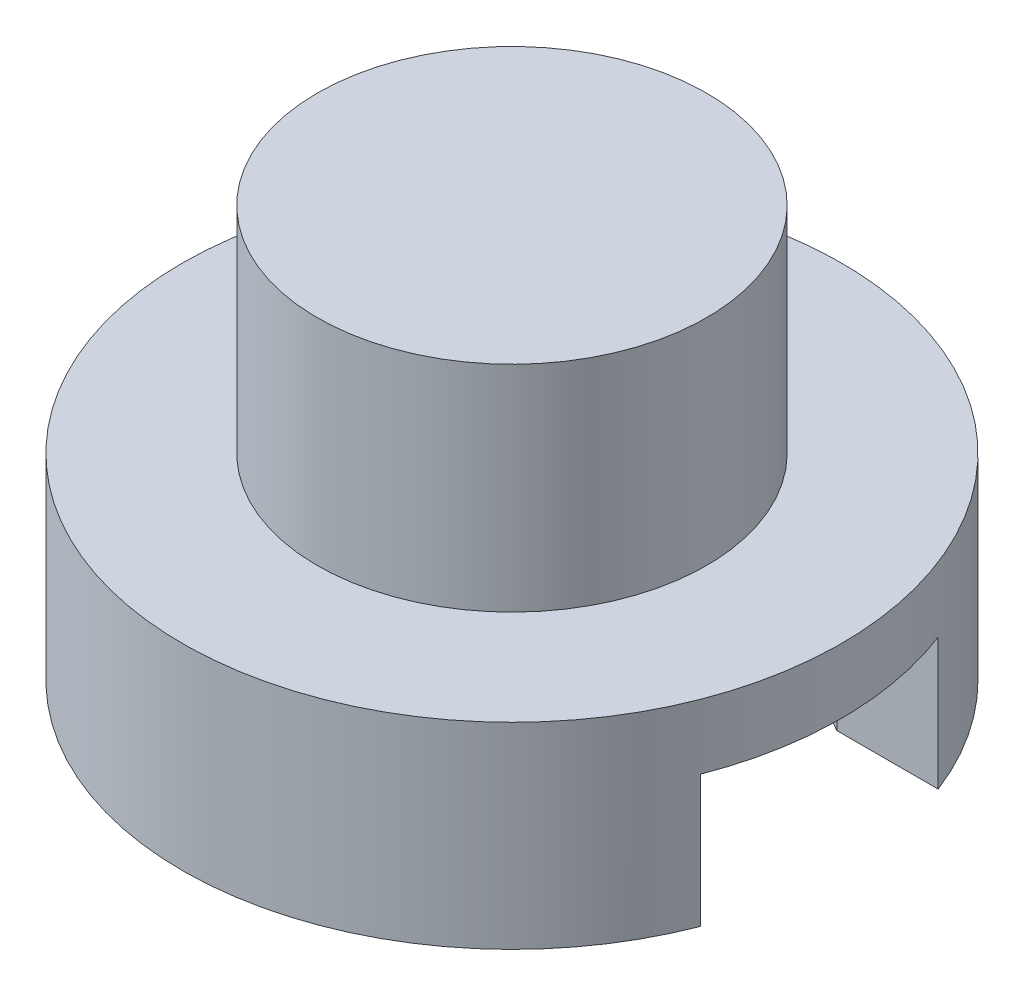
ISO-10303-21;
HEADER;
FILE_DESCRIPTION(('STEP AP214'),'2;1');
FILE_NAME('part.step','',(''),(''),'','','');
FILE_SCHEMA(('AUTOMOTIVE_DESIGN { 1 0 10303 214 1 1 1 1 }'));
ENDSEC;
DATA;
#1=APPLICATION_CONTEXT('core data for automotive mechanical design processes');
#2=APPLICATION_PROTOCOL_DEFINITION('international standard','automotive_design',2000,#1);
#3=PRODUCT_CONTEXT('',#1,'mechanical');
#4=PRODUCT('Part','Part','',(#3));
#5=PRODUCT_RELATED_PRODUCT_CATEGORY('part','',(#4));
#6=PRODUCT_DEFINITION_FORMATION('','',#4);
#7=PRODUCT_DEFINITION_CONTEXT('part definition',#1,'design');
#8=PRODUCT_DEFINITION('design','',#6,#7);
#9=PRODUCT_DEFINITION_SHAPE('','',#8);
#10=(LENGTH_UNIT() NAMED_UNIT(*) SI_UNIT(.MILLI.,.METRE.));
#11=(NAMED_UNIT(*) PLANE_ANGLE_UNIT() SI_UNIT($,.RADIAN.));
#12=(NAMED_UNIT(*) SI_UNIT($,.STERADIAN.) SOLID_ANGLE_UNIT());
#13=UNCERTAINTY_MEASURE_WITH_UNIT(LENGTH_MEASURE(1.E-05),#10,'distance_accuracy_value','');
#14=(GEOMETRIC_REPRESENTATION_CONTEXT(3) GLOBAL_UNCERTAINTY_ASSIGNED_CONTEXT((#13)) GLOBAL_UNIT_ASSIGNED_CONTEXT((#10,
#11,#12)) REPRESENTATION_CONTEXT('',''));
#15=CARTESIAN_POINT('',(0.,0.,0.));
#16=DIRECTION('',(0.,0.,1.));
#17=DIRECTION('',(1.,0.,0.));
#18=AXIS2_PLACEMENT_3D('',#15,#16,#17);
#19=CARTESIAN_POINT('',(2.51046511627907,25.25346,12.7));
#20=DIRECTION('',(0.,-1.,0.));
#21=DIRECTION('',(1.,0.,0.));
#22=AXIS2_PLACEMENT_3D('',#19,#20,#21);
#23=CYLINDRICAL_SURFACE('',#22,12.7);
#24=DIRECTION('',(0.,-1.,0.));
#25=VECTOR('',#24,1.);
#26=CARTESIAN_POINT('',(14.3548181132421,25.25346,8.11728223830729));
#27=LINE('',#26,#25);
#28=CARTESIAN_POINT('',(14.3548181132421,25.25346,8.11728223830729));
#29=VERTEX_POINT('',#28);
#30=CARTESIAN_POINT('',(14.3548181132421,20.17346,8.11728223830729));
#31=VERTEX_POINT('',#30);
#32=EDGE_CURVE('E142',#29,#31,#27,.T.);
#33=ORIENTED_EDGE('',*,*,#32,.T.);
#34=CARTESIAN_POINT('',(2.51046511627907,20.17346,12.7));
#35=DIRECTION('',(0.,1.,0.));
#36=DIRECTION('',(-1.,0.,0.));
#37=AXIS2_PLACEMENT_3D('',#34,#35,#36);
#38=CIRCLE('',#37,12.7);
#39=CARTESIAN_POINT('',(14.3548181132421,20.17346,17.2827177616926));
#40=VERTEX_POINT('',#39);
#41=EDGE_CURVE('E44',#31,#40,#38,.T.);
#42=ORIENTED_EDGE('',*,*,#41,.T.);
#43=DIRECTION('',(0.,-1.,0.));
#44=VECTOR('',#43,1.);
#45=CARTESIAN_POINT('',(14.3548181132421,25.25346,17.2827177616926));
#46=LINE('',#45,#44);
#47=CARTESIAN_POINT('',(14.3548181132421,25.25346,17.2827177616926));
#48=VERTEX_POINT('',#47);
#49=EDGE_CURVE('E39',#48,#40,#46,.T.);
#50=ORIENTED_EDGE('',*,*,#49,.F.);
#51=CARTESIAN_POINT('',(2.51046511627907,25.25346,12.7));
#52=DIRECTION('',(0.,1.,0.));
#53=DIRECTION('',(-1.,0.,0.));
#54=AXIS2_PLACEMENT_3D('',#51,#52,#53);
#55=CIRCLE('',#54,12.7);
#56=EDGE_CURVE('E99',#48,#29,#55,.T.);
#57=ORIENTED_EDGE('',*,*,#56,.T.);
#58=EDGE_LOOP('',(#33,#42,#50,#57));
#59=FACE_BOUND('',#58,.T.);
#60=CARTESIAN_POINT('',(2.51046511627907,27.75346,12.7));
#61=DIRECTION('',(0.,1.,0.));
#62=DIRECTION('',(-1.,0.,0.));
#63=AXIS2_PLACEMENT_3D('',#60,#61,#62);
#64=CIRCLE('',#63,12.7);
#65=CARTESIAN_POINT('',(-10.1895348837209,27.75346,12.7));
#66=VERTEX_POINT('',#65);
#67=EDGE_CURVE('E109',#66,#66,#64,.T.);
#68=ORIENTED_EDGE('',*,*,#67,.F.);
#69=EDGE_LOOP('',(#68));
#70=FACE_BOUND('',#69,.T.);
#71=ADVANCED_FACE('F36',(#59,#70),#23,.T.);
#72=CARTESIAN_POINT('',(0.,25.25346,17.2827177616926));
#73=DIRECTION('',(0.,0.,1.));
#74=DIRECTION('',(1.,0.,0.));
#75=AXIS2_PLACEMENT_3D('',#72,#73,#74);
#76=PLANE('',#75);
#77=DIRECTION('',(-1.,0.,0.));
#78=VECTOR('',#77,1.);
#79=CARTESIAN_POINT('',(0.,20.17346,17.2827177616926));
#80=LINE('',#79,#78);
#81=CARTESIAN_POINT('',(10.4479651162792,20.17346,17.2827177616926));
#82=VERTEX_POINT('',#81);
#83=EDGE_CURVE('E155',#40,#82,#80,.T.);
#84=ORIENTED_EDGE('',*,*,#83,.T.);
#85=DIRECTION('',(0.,-1.,0.));
#86=VECTOR('',#85,1.);
#87=CARTESIAN_POINT('',(10.4479651162792,25.25346,17.2827177616926));
#88=LINE('',#87,#86);
#89=CARTESIAN_POINT('',(10.4479651162792,25.25346,17.2827177616926));
#90=VERTEX_POINT('',#89);
#91=EDGE_CURVE('E117',#90,#82,#88,.T.);
#92=ORIENTED_EDGE('',*,*,#91,.F.);
#93=DIRECTION('',(-1.,0.,0.));
#94=VECTOR('',#93,1.);
#95=CARTESIAN_POINT('',(0.,25.25346,17.2827177616926));
#96=LINE('',#95,#94);
#97=EDGE_CURVE('E102',#48,#90,#96,.T.);
#98=ORIENTED_EDGE('',*,*,#97,.F.);
#99=ORIENTED_EDGE('',*,*,#49,.T.);
#100=EDGE_LOOP('',(#84,#92,#98,#99));
#101=FACE_BOUND('',#100,.T.);
#102=ADVANCED_FACE('F115',(#101),#76,.F.);
#103=CARTESIAN_POINT('',(10.0956275931009,25.25346,17.4861399255451));
#104=DIRECTION('',(-0.5,0.,-0.866025403784439));
#105=DIRECTION('',(-0.866025403784439,0.,0.5));
#106=AXIS2_PLACEMENT_3D('',#103,#104,#105);
#107=PLANE('',#106);
#108=DIRECTION('',(0.866025403784439,0.,-0.5));
#109=VECTOR('',#108,1.);
#110=CARTESIAN_POINT('',(10.0956275931009,20.17346,17.4861399255451));
#111=LINE('',#110,#109);
#112=CARTESIAN_POINT('',(2.51046511627918,20.17346,21.8654355233852));
#113=VERTEX_POINT('',#112);
#114=EDGE_CURVE('E153',#113,#82,#111,.T.);
#115=ORIENTED_EDGE('',*,*,#114,.F.);
#116=DIRECTION('',(0.,-1.,0.));
#117=VECTOR('',#116,1.);
#118=CARTESIAN_POINT('',(2.51046511627918,25.25346,21.8654355233852));
#119=LINE('',#118,#117);
#120=CARTESIAN_POINT('',(2.51046511627918,25.25346,21.8654355233852));
#121=VERTEX_POINT('',#120);
#122=EDGE_CURVE('E124',#121,#113,#119,.T.);
#123=ORIENTED_EDGE('',*,*,#122,.F.);
#124=DIRECTION('',(0.866025403784439,0.,-0.5));
#125=VECTOR('',#124,1.);
#126=CARTESIAN_POINT('',(10.0956275931009,25.25346,17.4861399255451));
#127=LINE('',#126,#125);
#128=EDGE_CURVE('E119',#121,#90,#127,.T.);
#129=ORIENTED_EDGE('',*,*,#128,.T.);
#130=ORIENTED_EDGE('',*,*,#91,.T.);
#131=EDGE_LOOP('',(#115,#123,#129,#130));
#132=FACE_BOUND('',#131,.T.);
#133=ADVANCED_FACE('F191',(#132),#107,.T.);
#134=CARTESIAN_POINT('',(-8.84039503496136,25.25346,15.3120133595327));
#135=DIRECTION('',(0.5,0.,-0.866025403784439));
#136=DIRECTION('',(-0.866025403784439,0.,-0.5));
#137=AXIS2_PLACEMENT_3D('',#134,#135,#136);
#138=PLANE('',#137);
#139=DIRECTION('',(0.866025403784439,0.,0.5));
#140=VECTOR('',#139,1.);
#141=CARTESIAN_POINT('',(-8.84039503496136,20.17346,15.3120133595327));
#142=LINE('',#141,#140);
#143=CARTESIAN_POINT('',(-5.42703488372084,20.17346,17.2827177616926));
#144=VERTEX_POINT('',#143);
#145=EDGE_CURVE('E151',#144,#113,#142,.T.);
#146=ORIENTED_EDGE('',*,*,#145,.F.);
#147=DIRECTION('',(0.,-1.,0.));
#148=VECTOR('',#147,1.);
#149=CARTESIAN_POINT('',(-5.42703488372084,25.25346,17.2827177616926));
#150=LINE('',#149,#148);
#151=CARTESIAN_POINT('',(-5.42703488372084,25.25346,17.2827177616926));
#152=VERTEX_POINT('',#151);
#153=EDGE_CURVE('E128',#152,#144,#150,.T.);
#154=ORIENTED_EDGE('',*,*,#153,.F.);
#155=DIRECTION('',(0.866025403784439,0.,0.5));
#156=VECTOR('',#155,1.);
#157=CARTESIAN_POINT('',(-8.84039503496136,25.25346,15.3120133595327));
#158=LINE('',#157,#156);
#159=EDGE_CURVE('E165',#152,#121,#158,.T.);
#160=ORIENTED_EDGE('',*,*,#159,.T.);
#161=ORIENTED_EDGE('',*,*,#122,.T.);
#162=EDGE_LOOP('',(#146,#154,#160,#161));
#163=FACE_BOUND('',#162,.T.);
#164=ADVANCED_FACE('F195',(#163),#138,.T.);
#165=CARTESIAN_POINT('',(-5.42703488372083,25.25346,0.));
#166=DIRECTION('',(1.,0.,0.));
#167=DIRECTION('',(0.,0.,-1.));
#168=AXIS2_PLACEMENT_3D('',#165,#166,#167);
#169=PLANE('',#168);
#170=DIRECTION('',(0.,0.,1.));
#171=VECTOR('',#170,1.);
#172=CARTESIAN_POINT('',(-5.42703488372083,20.17346,0.));
#173=LINE('',#172,#171);
#174=CARTESIAN_POINT('',(-5.42703488372083,20.17346,8.11728223830727));
#175=VERTEX_POINT('',#174);
#176=EDGE_CURVE('E149',#175,#144,#173,.T.);
#177=ORIENTED_EDGE('',*,*,#176,.F.);
#178=DIRECTION('',(0.,-1.,0.));
#179=VECTOR('',#178,1.);
#180=CARTESIAN_POINT('',(-5.42703488372083,25.25346,8.11728223830727));
#181=LINE('',#180,#179);
#182=CARTESIAN_POINT('',(-5.42703488372083,25.25346,8.11728223830727));
#183=VERTEX_POINT('',#182);
#184=EDGE_CURVE('E133',#183,#175,#181,.T.);
#185=ORIENTED_EDGE('',*,*,#184,.F.);
#186=DIRECTION('',(0.,0.,1.));
#187=VECTOR('',#186,1.);
#188=CARTESIAN_POINT('',(-5.42703488372083,25.25346,0.));
#189=LINE('',#188,#187);
#190=EDGE_CURVE('E162',#183,#152,#189,.T.);
#191=ORIENTED_EDGE('',*,*,#190,.T.);
#192=ORIENTED_EDGE('',*,*,#153,.T.);
#193=EDGE_LOOP('',(#177,#185,#191,#192));
#194=FACE_BOUND('',#193,.T.);
#195=ADVANCED_FACE('F200',(#194),#169,.T.);
#196=CARTESIAN_POINT('',(2.15812759310094,25.25346,3.73798664046717));
#197=DIRECTION('',(0.5,0.,0.866025403784439));
#198=DIRECTION('',(0.866025403784439,0.,-0.5));
#199=AXIS2_PLACEMENT_3D('',#196,#197,#198);
#200=PLANE('',#199);
#201=DIRECTION('',(-0.866025403784439,0.,0.5));
#202=VECTOR('',#201,1.);
#203=CARTESIAN_POINT('',(2.15812759310094,20.17346,3.73798664046717));
#204=LINE('',#203,#202);
#205=CARTESIAN_POINT('',(2.51046511627914,20.17346,3.53456447661463));
#206=VERTEX_POINT('',#205);
#207=EDGE_CURVE('E147',#206,#175,#204,.T.);
#208=ORIENTED_EDGE('',*,*,#207,.F.);
#209=DIRECTION('',(0.,-1.,0.));
#210=VECTOR('',#209,1.);
#211=CARTESIAN_POINT('',(2.51046511627914,25.25346,3.53456447661463));
#212=LINE('',#211,#210);
#213=CARTESIAN_POINT('',(2.51046511627914,25.25346,3.53456447661463));
#214=VERTEX_POINT('',#213);
#215=EDGE_CURVE('E136',#214,#206,#212,.T.);
#216=ORIENTED_EDGE('',*,*,#215,.F.);
#217=DIRECTION('',(-0.866025403784439,0.,0.5));
#218=VECTOR('',#217,1.);
#219=CARTESIAN_POINT('',(2.15812759310094,25.25346,3.73798664046717));
#220=LINE('',#219,#218);
#221=EDGE_CURVE('E159',#214,#183,#220,.T.);
#222=ORIENTED_EDGE('',*,*,#221,.T.);
#223=ORIENTED_EDGE('',*,*,#184,.T.);
#224=EDGE_LOOP('',(#208,#216,#222,#223));
#225=FACE_BOUND('',#224,.T.);
#226=ADVANCED_FACE('F204',(#225),#200,.T.);
#227=CARTESIAN_POINT('',(-0.902895034961375,25.25346,1.56386007445477));
#228=DIRECTION('',(-0.5,0.,0.866025403784439));
#229=DIRECTION('',(0.866025403784439,0.,0.5));
#230=AXIS2_PLACEMENT_3D('',#227,#228,#229);
#231=PLANE('',#230);
#232=DIRECTION('',(-0.866025403784439,0.,-0.5));
#233=VECTOR('',#232,1.);
#234=CARTESIAN_POINT('',(-0.902895034961374,20.17346,1.56386007445477));
#235=LINE('',#234,#233);
#236=CARTESIAN_POINT('',(10.4479651162792,20.17346,8.11728223830729));
#237=VERTEX_POINT('',#236);
#238=EDGE_CURVE('E145',#237,#206,#235,.T.);
#239=ORIENTED_EDGE('',*,*,#238,.F.);
#240=DIRECTION('',(0.,-1.,0.));
#241=VECTOR('',#240,1.);
#242=CARTESIAN_POINT('',(10.4479651162792,25.25346,8.11728223830729));
#243=LINE('',#242,#241);
#244=CARTESIAN_POINT('',(10.4479651162792,25.25346,8.11728223830729));
#245=VERTEX_POINT('',#244);
#246=EDGE_CURVE('E139',#245,#237,#243,.T.);
#247=ORIENTED_EDGE('',*,*,#246,.F.);
#248=DIRECTION('',(-0.866025403784439,0.,-0.5));
#249=VECTOR('',#248,1.);
#250=CARTESIAN_POINT('',(-0.902895034961375,25.25346,1.56386007445477));
#251=LINE('',#250,#249);
#252=EDGE_CURVE('E59',#245,#214,#251,.T.);
#253=ORIENTED_EDGE('',*,*,#252,.T.);
#254=ORIENTED_EDGE('',*,*,#215,.T.);
#255=EDGE_LOOP('',(#239,#247,#253,#254));
#256=FACE_BOUND('',#255,.T.);
#257=ADVANCED_FACE('F208',(#256),#231,.T.);
#258=CARTESIAN_POINT('',(0.,25.25346,8.11728223830729));
#259=DIRECTION('',(0.,0.,1.));
#260=DIRECTION('',(1.,0.,0.));
#261=AXIS2_PLACEMENT_3D('',#258,#259,#260);
#262=PLANE('',#261);
#263=DIRECTION('',(-1.,0.,0.));
#264=VECTOR('',#263,1.);
#265=CARTESIAN_POINT('',(0.,20.17346,8.11728223830729));
#266=LINE('',#265,#264);
#267=EDGE_CURVE('E120',#31,#237,#266,.T.);
#268=ORIENTED_EDGE('',*,*,#267,.F.);
#269=ORIENTED_EDGE('',*,*,#32,.F.);
#270=DIRECTION('',(-1.,0.,0.));
#271=VECTOR('',#270,1.);
#272=CARTESIAN_POINT('',(0.,25.25346,8.11728223830729));
#273=LINE('',#272,#271);
#274=EDGE_CURVE('E105',#29,#245,#273,.T.);
#275=ORIENTED_EDGE('',*,*,#274,.T.);
#276=ORIENTED_EDGE('',*,*,#246,.T.);
#277=EDGE_LOOP('',(#268,#269,#275,#276));
#278=FACE_BOUND('',#277,.T.);
#279=ADVANCED_FACE('F212',(#278),#262,.T.);
#280=CARTESIAN_POINT('',(0.,20.17346,0.));
#281=DIRECTION('',(0.,-1.,0.));
#282=DIRECTION('',(1.,0.,0.));
#283=AXIS2_PLACEMENT_3D('',#280,#281,#282);
#284=PLANE('',#283);
#285=ORIENTED_EDGE('',*,*,#41,.F.);
#286=ORIENTED_EDGE('',*,*,#267,.T.);
#287=ORIENTED_EDGE('',*,*,#238,.T.);
#288=ORIENTED_EDGE('',*,*,#207,.T.);
#289=ORIENTED_EDGE('',*,*,#176,.T.);
#290=ORIENTED_EDGE('',*,*,#145,.T.);
#291=ORIENTED_EDGE('',*,*,#114,.T.);
#292=ORIENTED_EDGE('',*,*,#83,.F.);
#293=EDGE_LOOP('',(#285,#286,#287,#288,#289,#290,#291,#292));
#294=FACE_BOUND('',#293,.T.);
#295=ADVANCED_FACE('F216',(#294),#284,.T.);
#296=CARTESIAN_POINT('',(2.51046511627907,25.25346,12.7));
#297=DIRECTION('',(0.,1.,0.));
#298=DIRECTION('',(-1.,0.,0.));
#299=AXIS2_PLACEMENT_3D('',#296,#297,#298);
#300=PLANE('',#299);
#301=ORIENTED_EDGE('',*,*,#56,.F.);
#302=ORIENTED_EDGE('',*,*,#97,.T.);
#303=ORIENTED_EDGE('',*,*,#128,.F.);
#304=ORIENTED_EDGE('',*,*,#159,.F.);
#305=ORIENTED_EDGE('',*,*,#190,.F.);
#306=ORIENTED_EDGE('',*,*,#221,.F.);
#307=ORIENTED_EDGE('',*,*,#252,.F.);
#308=ORIENTED_EDGE('',*,*,#274,.F.);
#309=EDGE_LOOP('',(#301,#302,#303,#304,#305,#306,#307,#308));
#310=FACE_BOUND('',#309,.T.);
#311=ADVANCED_FACE('F101',(#310),#300,.F.);
#312=CARTESIAN_POINT('',(2.51046511627907,27.75346,12.7));
#313=DIRECTION('',(0.,1.,0.));
#314=DIRECTION('',(-1.,0.,0.));
#315=AXIS2_PLACEMENT_3D('',#312,#313,#314);
#316=PLANE('',#315);
#317=CARTESIAN_POINT('',(2.51046511627907,27.75346,12.7));
#318=DIRECTION('',(0.,1.,0.));
#319=DIRECTION('',(-1.,0.,0.));
#320=AXIS2_PLACEMENT_3D('',#317,#318,#319);
#321=CIRCLE('',#320,7.5);
#322=CARTESIAN_POINT('',(-4.98953488372092,27.75346,12.7));
#323=VERTEX_POINT('',#322);
#324=EDGE_CURVE('E11',#323,#323,#321,.T.);
#325=ORIENTED_EDGE('',*,*,#324,.F.);
#326=EDGE_LOOP('',(#325));
#327=FACE_BOUND('',#326,.T.);
#328=ORIENTED_EDGE('',*,*,#67,.T.);
#329=EDGE_LOOP('',(#328));
#330=FACE_BOUND('',#329,.T.);
#331=ADVANCED_FACE('F179',(#327,#330),#316,.T.);
#332=CARTESIAN_POINT('',(2.51046511627907,36.02546,12.7));
#333=DIRECTION('',(0.,-1.,0.));
#334=DIRECTION('',(1.,0.,0.));
#335=AXIS2_PLACEMENT_3D('',#332,#333,#334);
#336=CYLINDRICAL_SURFACE('',#335,7.5);
#337=CARTESIAN_POINT('',(2.51046511627907,36.02546,12.7));
#338=DIRECTION('',(0.,1.,0.));
#339=DIRECTION('',(-1.,0.,0.));
#340=AXIS2_PLACEMENT_3D('',#337,#338,#339);
#341=CIRCLE('',#340,7.5);
#342=CARTESIAN_POINT('',(-4.98953488372092,36.02546,12.7));
#343=VERTEX_POINT('',#342);
#344=EDGE_CURVE('E110',#343,#343,#341,.T.);
#345=ORIENTED_EDGE('',*,*,#344,.F.);
#346=EDGE_LOOP('',(#345));
#347=FACE_BOUND('',#346,.T.);
#348=ORIENTED_EDGE('',*,*,#324,.T.);
#349=EDGE_LOOP('',(#348));
#350=FACE_BOUND('',#349,.T.);
#351=ADVANCED_FACE('F176',(#347,#350),#336,.T.);
#352=CARTESIAN_POINT('',(0.,36.02546,0.));
#353=DIRECTION('',(0.,1.,0.));
#354=DIRECTION('',(-1.,0.,0.));
#355=AXIS2_PLACEMENT_3D('',#352,#353,#354);
#356=PLANE('',#355);
#357=ORIENTED_EDGE('',*,*,#344,.T.);
#358=EDGE_LOOP('',(#357));
#359=FACE_BOUND('',#358,.T.);
#360=ADVANCED_FACE('F174',(#359),#356,.T.);
#361=CLOSED_SHELL('',(#71,#102,#133,#164,#195,#226,#257,#279,#295,#311,#331,#351,#360));
#362=MANIFOLD_SOLID_BREP('B2',#361);
#363=ADVANCED_BREP_SHAPE_REPRESENTATION('',(#18,#362),#14);
#364=SHAPE_DEFINITION_REPRESENTATION(#9,#363);
ENDSEC;
END-ISO-10303-21;
